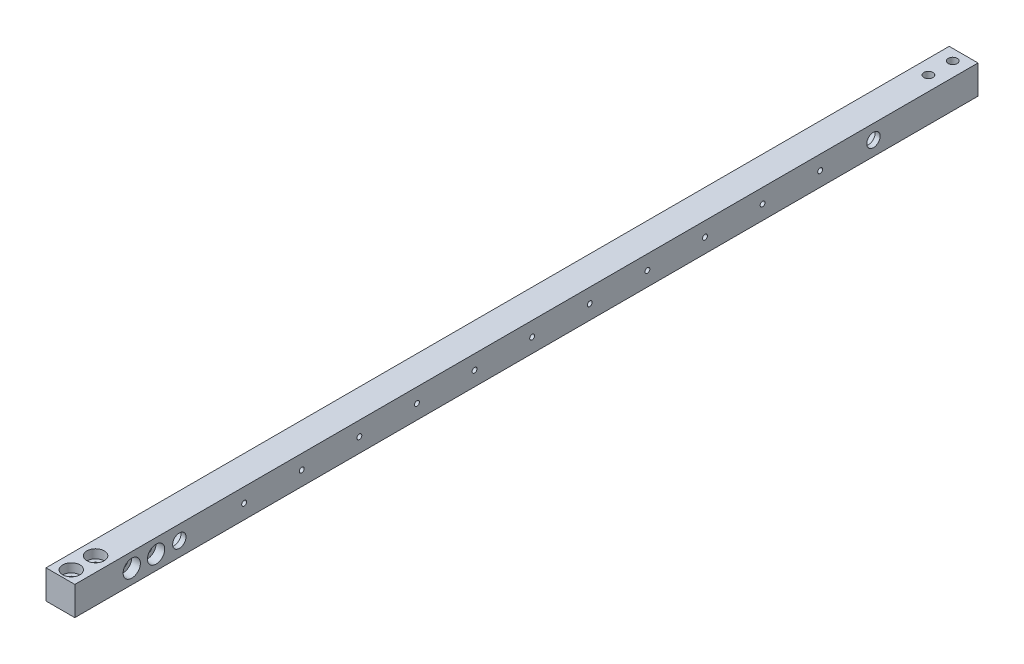
ISO-10303-21;
HEADER;
FILE_DESCRIPTION(('STEP AP214'),'2;1');
FILE_NAME('part.step','',(''),(''),'','','');
FILE_SCHEMA(('AUTOMOTIVE_DESIGN { 1 0 10303 214 1 1 1 1 }'));
ENDSEC;
DATA;
#1=APPLICATION_CONTEXT('core data for automotive mechanical design processes');
#2=APPLICATION_PROTOCOL_DEFINITION('international standard','automotive_design',2000,#1);
#3=PRODUCT_CONTEXT('',#1,'mechanical');
#4=PRODUCT('Part','Part','',(#3));
#5=PRODUCT_RELATED_PRODUCT_CATEGORY('part','',(#4));
#6=PRODUCT_DEFINITION_FORMATION('','',#4);
#7=PRODUCT_DEFINITION_CONTEXT('part definition',#1,'design');
#8=PRODUCT_DEFINITION('design','',#6,#7);
#9=PRODUCT_DEFINITION_SHAPE('','',#8);
#10=(LENGTH_UNIT() NAMED_UNIT(*) SI_UNIT(.MILLI.,.METRE.));
#11=(NAMED_UNIT(*) PLANE_ANGLE_UNIT() SI_UNIT($,.RADIAN.));
#12=(NAMED_UNIT(*) SI_UNIT($,.STERADIAN.) SOLID_ANGLE_UNIT());
#13=UNCERTAINTY_MEASURE_WITH_UNIT(LENGTH_MEASURE(1.E-05),#10,'distance_accuracy_value','');
#14=(GEOMETRIC_REPRESENTATION_CONTEXT(3) GLOBAL_UNCERTAINTY_ASSIGNED_CONTEXT((#13)) GLOBAL_UNIT_ASSIGNED_CONTEXT((#10,
#11,#12)) REPRESENTATION_CONTEXT('',''));
#15=CARTESIAN_POINT('',(0.,0.,0.));
#16=DIRECTION('',(0.,0.,1.));
#17=DIRECTION('',(1.,0.,0.));
#18=AXIS2_PLACEMENT_3D('',#15,#16,#17);
#19=CARTESIAN_POINT('',(0.,0.,497.84));
#20=DIRECTION('',(1.,0.,0.));
#21=DIRECTION('',(0.,1.,0.));
#22=AXIS2_PLACEMENT_3D('',#19,#20,#21);
#23=PLANE('',#22);
#24=CARTESIAN_POINT('',(0.,7.93750000000015,453.04));
#25=DIRECTION('',(1.,0.,0.));
#26=DIRECTION('',(0.,1.,0.));
#27=AXIS2_PLACEMENT_3D('',#24,#25,#26);
#28=CIRCLE('',#27,2.4892);
#29=CARTESIAN_POINT('',(0.,10.4267000000001,453.04));
#30=VERTEX_POINT('',#29);
#31=EDGE_CURVE('E40',#30,#30,#28,.T.);
#32=ORIENTED_EDGE('',*,*,#31,.T.);
#33=EDGE_LOOP('',(#32));
#34=FACE_BOUND('',#33,.T.);
#35=CARTESIAN_POINT('',(0.,7.93750000000015,466.44));
#36=DIRECTION('',(1.,0.,0.));
#37=DIRECTION('',(0.,1.,0.));
#38=AXIS2_PLACEMENT_3D('',#35,#36,#37);
#39=CIRCLE('',#38,2.4892);
#40=CARTESIAN_POINT('',(0.,10.4267000000001,466.44));
#41=VERTEX_POINT('',#40);
#42=EDGE_CURVE('E170',#41,#41,#39,.T.);
#43=ORIENTED_EDGE('',*,*,#42,.T.);
#44=EDGE_LOOP('',(#43));
#45=FACE_BOUND('',#44,.T.);
#46=CARTESIAN_POINT('',(0.,7.93749999999993,404.495));
#47=DIRECTION('',(1.,0.,0.));
#48=DIRECTION('',(0.,0.,-1.));
#49=AXIS2_PLACEMENT_3D('',#46,#47,#48);
#50=CIRCLE('',#49,1.35254999999993);
#51=CARTESIAN_POINT('',(0.,7.93749999999993,403.14245));
#52=VERTEX_POINT('',#51);
#53=EDGE_CURVE('E151',#52,#52,#50,.T.);
#54=ORIENTED_EDGE('',*,*,#53,.T.);
#55=EDGE_LOOP('',(#54));
#56=FACE_BOUND('',#55,.T.);
#57=CARTESIAN_POINT('',(0.,7.93749999999993,372.745));
#58=DIRECTION('',(1.,0.,0.));
#59=DIRECTION('',(0.,0.,-1.));
#60=AXIS2_PLACEMENT_3D('',#57,#58,#59);
#61=CIRCLE('',#60,1.35254999999993);
#62=CARTESIAN_POINT('',(0.,7.93749999999993,371.39245));
#63=VERTEX_POINT('',#62);
#64=EDGE_CURVE('E147',#63,#63,#61,.T.);
#65=ORIENTED_EDGE('',*,*,#64,.T.);
#66=EDGE_LOOP('',(#65));
#67=FACE_BOUND('',#66,.T.);
#68=CARTESIAN_POINT('',(0.,7.93749999999993,340.995));
#69=DIRECTION('',(1.,0.,0.));
#70=DIRECTION('',(0.,0.,-1.));
#71=AXIS2_PLACEMENT_3D('',#68,#69,#70);
#72=CIRCLE('',#71,1.35254999999993);
#73=CARTESIAN_POINT('',(0.,7.93749999999993,339.64245));
#74=VERTEX_POINT('',#73);
#75=EDGE_CURVE('E146',#74,#74,#72,.T.);
#76=ORIENTED_EDGE('',*,*,#75,.T.);
#77=EDGE_LOOP('',(#76));
#78=FACE_BOUND('',#77,.T.);
#79=CARTESIAN_POINT('',(0.,7.93749999999993,309.245));
#80=DIRECTION('',(1.,0.,0.));
#81=DIRECTION('',(0.,0.,-1.));
#82=AXIS2_PLACEMENT_3D('',#79,#80,#81);
#83=CIRCLE('',#82,1.35254999999993);
#84=CARTESIAN_POINT('',(0.,7.93749999999993,307.89245));
#85=VERTEX_POINT('',#84);
#86=EDGE_CURVE('E142',#85,#85,#83,.T.);
#87=ORIENTED_EDGE('',*,*,#86,.T.);
#88=EDGE_LOOP('',(#87));
#89=FACE_BOUND('',#88,.T.);
#90=CARTESIAN_POINT('',(0.,7.93749999999993,277.495));
#91=DIRECTION('',(1.,0.,0.));
#92=DIRECTION('',(0.,0.,-1.));
#93=AXIS2_PLACEMENT_3D('',#90,#91,#92);
#94=CIRCLE('',#93,1.35254999999993);
#95=CARTESIAN_POINT('',(0.,7.93749999999993,276.14245));
#96=VERTEX_POINT('',#95);
#97=EDGE_CURVE('E138',#96,#96,#94,.T.);
#98=ORIENTED_EDGE('',*,*,#97,.T.);
#99=EDGE_LOOP('',(#98));
#100=FACE_BOUND('',#99,.T.);
#101=CARTESIAN_POINT('',(0.,7.93749999999993,245.745));
#102=DIRECTION('',(1.,0.,0.));
#103=DIRECTION('',(0.,0.,-1.));
#104=AXIS2_PLACEMENT_3D('',#101,#102,#103);
#105=CIRCLE('',#104,1.35254999999993);
#106=CARTESIAN_POINT('',(0.,7.93749999999993,244.39245));
#107=VERTEX_POINT('',#106);
#108=EDGE_CURVE('E134',#107,#107,#105,.T.);
#109=ORIENTED_EDGE('',*,*,#108,.T.);
#110=EDGE_LOOP('',(#109));
#111=FACE_BOUND('',#110,.T.);
#112=CARTESIAN_POINT('',(0.,7.93749999999993,213.995));
#113=DIRECTION('',(1.,0.,0.));
#114=DIRECTION('',(0.,0.,-1.));
#115=AXIS2_PLACEMENT_3D('',#112,#113,#114);
#116=CIRCLE('',#115,1.35254999999993);
#117=CARTESIAN_POINT('',(0.,7.93749999999993,212.64245));
#118=VERTEX_POINT('',#117);
#119=EDGE_CURVE('E130',#118,#118,#116,.T.);
#120=ORIENTED_EDGE('',*,*,#119,.T.);
#121=EDGE_LOOP('',(#120));
#122=FACE_BOUND('',#121,.T.);
#123=CARTESIAN_POINT('',(0.,7.93749999999993,182.245));
#124=DIRECTION('',(1.,0.,0.));
#125=DIRECTION('',(0.,0.,-1.));
#126=AXIS2_PLACEMENT_3D('',#123,#124,#125);
#127=CIRCLE('',#126,1.35254999999993);
#128=CARTESIAN_POINT('',(0.,7.93749999999993,180.89245));
#129=VERTEX_POINT('',#128);
#130=EDGE_CURVE('E126',#129,#129,#127,.T.);
#131=ORIENTED_EDGE('',*,*,#130,.T.);
#132=EDGE_LOOP('',(#131));
#133=FACE_BOUND('',#132,.T.);
#134=CARTESIAN_POINT('',(0.,7.93749999999993,150.495));
#135=DIRECTION('',(1.,0.,0.));
#136=DIRECTION('',(0.,0.,-1.));
#137=AXIS2_PLACEMENT_3D('',#134,#135,#136);
#138=CIRCLE('',#137,1.35254999999993);
#139=CARTESIAN_POINT('',(0.,7.93749999999993,149.14245));
#140=VERTEX_POINT('',#139);
#141=EDGE_CURVE('E125',#140,#140,#138,.T.);
#142=ORIENTED_EDGE('',*,*,#141,.T.);
#143=EDGE_LOOP('',(#142));
#144=FACE_BOUND('',#143,.T.);
#145=CARTESIAN_POINT('',(0.,7.93749999999993,118.745));
#146=DIRECTION('',(1.,0.,0.));
#147=DIRECTION('',(0.,0.,-1.));
#148=AXIS2_PLACEMENT_3D('',#145,#146,#147);
#149=CIRCLE('',#148,1.35254999999993);
#150=CARTESIAN_POINT('',(0.,7.93749999999993,117.39245));
#151=VERTEX_POINT('',#150);
#152=EDGE_CURVE('E121',#151,#151,#149,.T.);
#153=ORIENTED_EDGE('',*,*,#152,.T.);
#154=EDGE_LOOP('',(#153));
#155=FACE_BOUND('',#154,.T.);
#156=CARTESIAN_POINT('',(0.,7.93749999999993,86.9949999999997));
#157=DIRECTION('',(1.,0.,0.));
#158=DIRECTION('',(0.,0.,-1.));
#159=AXIS2_PLACEMENT_3D('',#156,#157,#158);
#160=CIRCLE('',#159,1.35254999999993);
#161=CARTESIAN_POINT('',(0.,7.93749999999993,85.6424499999998));
#162=VERTEX_POINT('',#161);
#163=EDGE_CURVE('E120',#162,#162,#160,.T.);
#164=ORIENTED_EDGE('',*,*,#163,.T.);
#165=EDGE_LOOP('',(#164));
#166=FACE_BOUND('',#165,.T.);
#167=CARTESIAN_POINT('',(0.,7.93749999999995,57.6199));
#168=DIRECTION('',(-1.,0.,0.));
#169=DIRECTION('',(0.,1.,0.));
#170=AXIS2_PLACEMENT_3D('',#167,#168,#169);
#171=CIRCLE('',#170,6.81989999999999);
#172=CARTESIAN_POINT('',(0.,14.7573999999999,57.6199));
#173=VERTEX_POINT('',#172);
#174=EDGE_CURVE('E252',#173,#173,#171,.T.);
#175=ORIENTED_EDGE('',*,*,#174,.F.);
#176=EDGE_LOOP('',(#175));
#177=FACE_BOUND('',#176,.T.);
#178=CARTESIAN_POINT('',(0.,7.93749999999999,440.2201));
#179=DIRECTION('',(-1.,0.,0.));
#180=DIRECTION('',(0.,-1.,0.));
#181=AXIS2_PLACEMENT_3D('',#178,#179,#180);
#182=CIRCLE('',#181,6.81989999999997);
#183=CARTESIAN_POINT('',(0.,1.11760000000003,440.2201));
#184=VERTEX_POINT('',#183);
#185=EDGE_CURVE('E256',#184,#184,#182,.T.);
#186=ORIENTED_EDGE('',*,*,#185,.F.);
#187=EDGE_LOOP('',(#186));
#188=FACE_BOUND('',#187,.T.);
#189=DIRECTION('',(0.,-1.,0.));
#190=VECTOR('',#189,1.);
#191=CARTESIAN_POINT('',(0.,0.,0.));
#192=LINE('',#191,#190);
#193=CARTESIAN_POINT('',(0.,15.875,0.));
#194=VERTEX_POINT('',#193);
#195=CARTESIAN_POINT('',(0.,0.,0.));
#196=VERTEX_POINT('',#195);
#197=EDGE_CURVE('E103',#194,#196,#192,.T.);
#198=ORIENTED_EDGE('',*,*,#197,.T.);
#199=DIRECTION('',(0.,0.,-1.));
#200=VECTOR('',#199,1.);
#201=CARTESIAN_POINT('',(0.,0.,497.84));
#202=LINE('',#201,#200);
#203=CARTESIAN_POINT('',(0.,0.,497.84));
#204=VERTEX_POINT('',#203);
#205=EDGE_CURVE('E11',#204,#196,#202,.T.);
#206=ORIENTED_EDGE('',*,*,#205,.F.);
#207=DIRECTION('',(0.,-1.,0.));
#208=VECTOR('',#207,1.);
#209=CARTESIAN_POINT('',(0.,0.,497.84));
#210=LINE('',#209,#208);
#211=CARTESIAN_POINT('',(0.,15.875,497.84));
#212=VERTEX_POINT('',#211);
#213=EDGE_CURVE('E90',#212,#204,#210,.T.);
#214=ORIENTED_EDGE('',*,*,#213,.F.);
#215=DIRECTION('',(0.,0.,-1.));
#216=VECTOR('',#215,1.);
#217=CARTESIAN_POINT('',(0.,15.875,497.84));
#218=LINE('',#217,#216);
#219=EDGE_CURVE('E99',#212,#194,#218,.T.);
#220=ORIENTED_EDGE('',*,*,#219,.T.);
#221=EDGE_LOOP('',(#198,#206,#214,#220));
#222=FACE_BOUND('',#221,.T.);
#223=ADVANCED_FACE('F37',(#34,#45,#56,#67,#78,#89,#100,#111,#122,#133,#144,#155,#166,#177,#188,
#222),#23,.F.);
#224=CARTESIAN_POINT('',(0.,0.,497.84));
#225=DIRECTION('',(0.,1.,0.));
#226=DIRECTION('',(0.,0.,1.));
#227=AXIS2_PLACEMENT_3D('',#224,#225,#226);
#228=PLANE('',#227);
#229=CARTESIAN_POINT('',(7.9374999999996,-2.15233061408304E-13,19.3999999999996));
#230=DIRECTION('',(0.,-1.,0.));
#231=DIRECTION('',(0.,0.,-1.));
#232=AXIS2_PLACEMENT_3D('',#229,#230,#231);
#233=CIRCLE('',#232,4.7625);
#234=CARTESIAN_POINT('',(7.9374999999996,-2.15233061408304E-13,14.6374999999996));
#235=VERTEX_POINT('',#234);
#236=EDGE_CURVE('E172',#235,#235,#233,.T.);
#237=ORIENTED_EDGE('',*,*,#236,.F.);
#238=EDGE_LOOP('',(#237));
#239=FACE_BOUND('',#238,.T.);
#240=CARTESIAN_POINT('',(7.9374999999996,-2.21183856820295E-13,5.99999999999956));
#241=DIRECTION('',(0.,-1.,0.));
#242=DIRECTION('',(0.,0.,-1.));
#243=AXIS2_PLACEMENT_3D('',#240,#241,#242);
#244=CIRCLE('',#243,4.7625);
#245=CARTESIAN_POINT('',(7.9374999999996,-2.21183856820295E-13,1.23749999999956));
#246=VERTEX_POINT('',#245);
#247=EDGE_CURVE('E168',#246,#246,#244,.T.);
#248=ORIENTED_EDGE('',*,*,#247,.F.);
#249=EDGE_LOOP('',(#248));
#250=FACE_BOUND('',#249,.T.);
#251=CARTESIAN_POINT('',(7.93749999999949,0.,478.44));
#252=DIRECTION('',(0.,1.,0.));
#253=DIRECTION('',(0.,0.,1.));
#254=AXIS2_PLACEMENT_3D('',#251,#252,#253);
#255=CIRCLE('',#254,2.4892);
#256=CARTESIAN_POINT('',(7.93749999999949,0.,480.9292));
#257=VERTEX_POINT('',#256);
#258=EDGE_CURVE('E156',#257,#257,#255,.T.);
#259=ORIENTED_EDGE('',*,*,#258,.T.);
#260=EDGE_LOOP('',(#259));
#261=FACE_BOUND('',#260,.T.);
#262=CARTESIAN_POINT('',(7.93749999999949,0.,491.839999999999));
#263=DIRECTION('',(0.,1.,0.));
#264=DIRECTION('',(0.,0.,1.));
#265=AXIS2_PLACEMENT_3D('',#262,#263,#264);
#266=CIRCLE('',#265,2.4892);
#267=CARTESIAN_POINT('',(7.93749999999949,0.,494.329199999999));
#268=VERTEX_POINT('',#267);
#269=EDGE_CURVE('E152',#268,#268,#266,.T.);
#270=ORIENTED_EDGE('',*,*,#269,.T.);
#271=EDGE_LOOP('',(#270));
#272=FACE_BOUND('',#271,.T.);
#273=DIRECTION('',(1.,0.,0.));
#274=VECTOR('',#273,1.);
#275=CARTESIAN_POINT('',(0.,0.,0.));
#276=LINE('',#275,#274);
#277=CARTESIAN_POINT('',(15.875,0.,0.));
#278=VERTEX_POINT('',#277);
#279=EDGE_CURVE('E94',#196,#278,#276,.T.);
#280=ORIENTED_EDGE('',*,*,#279,.T.);
#281=DIRECTION('',(0.,0.,-1.));
#282=VECTOR('',#281,1.);
#283=CARTESIAN_POINT('',(15.875,0.,497.84));
#284=LINE('',#283,#282);
#285=CARTESIAN_POINT('',(15.875,0.,497.84));
#286=VERTEX_POINT('',#285);
#287=EDGE_CURVE('E46',#286,#278,#284,.T.);
#288=ORIENTED_EDGE('',*,*,#287,.F.);
#289=DIRECTION('',(1.,0.,0.));
#290=VECTOR('',#289,1.);
#291=CARTESIAN_POINT('',(0.,0.,497.84));
#292=LINE('',#291,#290);
#293=EDGE_CURVE('E85',#204,#286,#292,.T.);
#294=ORIENTED_EDGE('',*,*,#293,.F.);
#295=ORIENTED_EDGE('',*,*,#205,.T.);
#296=EDGE_LOOP('',(#280,#288,#294,#295));
#297=FACE_BOUND('',#296,.T.);
#298=ADVANCED_FACE('F93',(#239,#250,#261,#272,#297),#228,.F.);
#299=CARTESIAN_POINT('',(15.875,0.,497.84));
#300=DIRECTION('',(-1.,0.,0.));
#301=DIRECTION('',(0.,-1.,0.));
#302=AXIS2_PLACEMENT_3D('',#299,#300,#301);
#303=PLANE('',#302);
#304=CARTESIAN_POINT('',(15.875,7.93750000000015,453.04));
#305=DIRECTION('',(1.,0.,0.));
#306=DIRECTION('',(0.,0.,-1.));
#307=AXIS2_PLACEMENT_3D('',#304,#305,#306);
#308=CIRCLE('',#307,4.7625);
#309=CARTESIAN_POINT('',(15.875,7.93750000000015,448.2775));
#310=VERTEX_POINT('',#309);
#311=EDGE_CURVE('E646',#310,#310,#308,.T.);
#312=ORIENTED_EDGE('',*,*,#311,.F.);
#313=EDGE_LOOP('',(#312));
#314=FACE_BOUND('',#313,.T.);
#315=CARTESIAN_POINT('',(15.875,7.93750000000015,466.44));
#316=DIRECTION('',(1.,0.,0.));
#317=DIRECTION('',(0.,0.,-1.));
#318=AXIS2_PLACEMENT_3D('',#315,#316,#317);
#319=CIRCLE('',#318,4.7625);
#320=CARTESIAN_POINT('',(15.875,7.93750000000015,461.6775));
#321=VERTEX_POINT('',#320);
#322=EDGE_CURVE('E185',#321,#321,#319,.T.);
#323=ORIENTED_EDGE('',*,*,#322,.F.);
#324=EDGE_LOOP('',(#323));
#325=FACE_BOUND('',#324,.T.);
#326=CARTESIAN_POINT('',(15.875,7.93749999999993,404.495));
#327=DIRECTION('',(-1.,0.,0.));
#328=DIRECTION('',(0.,-1.,0.));
#329=AXIS2_PLACEMENT_3D('',#326,#327,#328);
#330=CIRCLE('',#329,1.35254999999997);
#331=CARTESIAN_POINT('',(15.875,6.58494999999997,404.495));
#332=VERTEX_POINT('',#331);
#333=EDGE_CURVE('E148',#332,#332,#330,.T.);
#334=ORIENTED_EDGE('',*,*,#333,.T.);
#335=EDGE_LOOP('',(#334));
#336=FACE_BOUND('',#335,.T.);
#337=CARTESIAN_POINT('',(15.875,7.93749999999993,372.745));
#338=DIRECTION('',(-1.,0.,0.));
#339=DIRECTION('',(0.,-1.,0.));
#340=AXIS2_PLACEMENT_3D('',#337,#338,#339);
#341=CIRCLE('',#340,1.35254999999997);
#342=CARTESIAN_POINT('',(15.875,6.58494999999997,372.745));
#343=VERTEX_POINT('',#342);
#344=EDGE_CURVE('E143',#343,#343,#341,.T.);
#345=ORIENTED_EDGE('',*,*,#344,.T.);
#346=EDGE_LOOP('',(#345));
#347=FACE_BOUND('',#346,.T.);
#348=CARTESIAN_POINT('',(15.875,7.93749999999993,340.995));
#349=DIRECTION('',(-1.,0.,0.));
#350=DIRECTION('',(0.,-1.,0.));
#351=AXIS2_PLACEMENT_3D('',#348,#349,#350);
#352=CIRCLE('',#351,1.35254999999997);
#353=CARTESIAN_POINT('',(15.875,6.58494999999997,340.995));
#354=VERTEX_POINT('',#353);
#355=EDGE_CURVE('E220',#354,#354,#352,.T.);
#356=ORIENTED_EDGE('',*,*,#355,.T.);
#357=EDGE_LOOP('',(#356));
#358=FACE_BOUND('',#357,.T.);
#359=CARTESIAN_POINT('',(15.875,7.93749999999993,309.245));
#360=DIRECTION('',(-1.,0.,0.));
#361=DIRECTION('',(0.,-1.,0.));
#362=AXIS2_PLACEMENT_3D('',#359,#360,#361);
#363=CIRCLE('',#362,1.35254999999997);
#364=CARTESIAN_POINT('',(15.875,6.58494999999997,309.245));
#365=VERTEX_POINT('',#364);
#366=EDGE_CURVE('E139',#365,#365,#363,.T.);
#367=ORIENTED_EDGE('',*,*,#366,.T.);
#368=EDGE_LOOP('',(#367));
#369=FACE_BOUND('',#368,.T.);
#370=CARTESIAN_POINT('',(15.875,7.93749999999993,277.495));
#371=DIRECTION('',(-1.,0.,0.));
#372=DIRECTION('',(0.,-1.,0.));
#373=AXIS2_PLACEMENT_3D('',#370,#371,#372);
#374=CIRCLE('',#373,1.35254999999997);
#375=CARTESIAN_POINT('',(15.875,6.58494999999997,277.495));
#376=VERTEX_POINT('',#375);
#377=EDGE_CURVE('E135',#376,#376,#374,.T.);
#378=ORIENTED_EDGE('',*,*,#377,.T.);
#379=EDGE_LOOP('',(#378));
#380=FACE_BOUND('',#379,.T.);
#381=CARTESIAN_POINT('',(15.875,7.93749999999993,245.745));
#382=DIRECTION('',(-1.,0.,0.));
#383=DIRECTION('',(0.,-1.,0.));
#384=AXIS2_PLACEMENT_3D('',#381,#382,#383);
#385=CIRCLE('',#384,1.35254999999997);
#386=CARTESIAN_POINT('',(15.875,6.58494999999997,245.745));
#387=VERTEX_POINT('',#386);
#388=EDGE_CURVE('E131',#387,#387,#385,.T.);
#389=ORIENTED_EDGE('',*,*,#388,.T.);
#390=EDGE_LOOP('',(#389));
#391=FACE_BOUND('',#390,.T.);
#392=CARTESIAN_POINT('',(15.875,7.93749999999993,213.995));
#393=DIRECTION('',(-1.,0.,0.));
#394=DIRECTION('',(0.,-1.,0.));
#395=AXIS2_PLACEMENT_3D('',#392,#393,#394);
#396=CIRCLE('',#395,1.35254999999997);
#397=CARTESIAN_POINT('',(15.875,6.58494999999997,213.995));
#398=VERTEX_POINT('',#397);
#399=EDGE_CURVE('E127',#398,#398,#396,.T.);
#400=ORIENTED_EDGE('',*,*,#399,.T.);
#401=EDGE_LOOP('',(#400));
#402=FACE_BOUND('',#401,.T.);
#403=CARTESIAN_POINT('',(15.875,7.93749999999993,182.245));
#404=DIRECTION('',(-1.,0.,0.));
#405=DIRECTION('',(0.,-1.,0.));
#406=AXIS2_PLACEMENT_3D('',#403,#404,#405);
#407=CIRCLE('',#406,1.35254999999997);
#408=CARTESIAN_POINT('',(15.875,6.58494999999997,182.245));
#409=VERTEX_POINT('',#408);
#410=EDGE_CURVE('E122',#409,#409,#407,.T.);
#411=ORIENTED_EDGE('',*,*,#410,.T.);
#412=EDGE_LOOP('',(#411));
#413=FACE_BOUND('',#412,.T.);
#414=CARTESIAN_POINT('',(15.875,7.93749999999993,150.495));
#415=DIRECTION('',(-1.,0.,0.));
#416=DIRECTION('',(0.,-1.,0.));
#417=AXIS2_PLACEMENT_3D('',#414,#415,#416);
#418=CIRCLE('',#417,1.35254999999997);
#419=CARTESIAN_POINT('',(15.875,6.58494999999997,150.495));
#420=VERTEX_POINT('',#419);
#421=EDGE_CURVE('E235',#420,#420,#418,.T.);
#422=ORIENTED_EDGE('',*,*,#421,.T.);
#423=EDGE_LOOP('',(#422));
#424=FACE_BOUND('',#423,.T.);
#425=CARTESIAN_POINT('',(15.875,7.93749999999993,118.745));
#426=DIRECTION('',(-1.,0.,0.));
#427=DIRECTION('',(0.,-1.,0.));
#428=AXIS2_PLACEMENT_3D('',#425,#426,#427);
#429=CIRCLE('',#428,1.35254999999997);
#430=CARTESIAN_POINT('',(15.875,6.58494999999997,118.745));
#431=VERTEX_POINT('',#430);
#432=EDGE_CURVE('E117',#431,#431,#429,.T.);
#433=ORIENTED_EDGE('',*,*,#432,.T.);
#434=EDGE_LOOP('',(#433));
#435=FACE_BOUND('',#434,.T.);
#436=CARTESIAN_POINT('',(15.875,7.93749999999993,86.9949999999997));
#437=DIRECTION('',(-1.,0.,0.));
#438=DIRECTION('',(0.,-1.,0.));
#439=AXIS2_PLACEMENT_3D('',#436,#437,#438);
#440=CIRCLE('',#439,1.35254999999997);
#441=CARTESIAN_POINT('',(15.875,6.58494999999997,86.9949999999997));
#442=VERTEX_POINT('',#441);
#443=EDGE_CURVE('E242',#442,#442,#440,.T.);
#444=ORIENTED_EDGE('',*,*,#443,.T.);
#445=EDGE_LOOP('',(#444));
#446=FACE_BOUND('',#445,.T.);
#447=CARTESIAN_POINT('',(15.875,7.93749999999995,57.6199));
#448=DIRECTION('',(-1.,0.,0.));
#449=DIRECTION('',(0.,-1.,0.));
#450=AXIS2_PLACEMENT_3D('',#447,#448,#449);
#451=CIRCLE('',#450,3.68299999999999);
#452=CARTESIAN_POINT('',(15.875,4.25449999999996,57.6199));
#453=VERTEX_POINT('',#452);
#454=EDGE_CURVE('E112',#453,#453,#451,.T.);
#455=ORIENTED_EDGE('',*,*,#454,.T.);
#456=EDGE_LOOP('',(#455));
#457=FACE_BOUND('',#456,.T.);
#458=CARTESIAN_POINT('',(15.875,7.93749999999999,440.2201));
#459=DIRECTION('',(-1.,0.,0.));
#460=DIRECTION('',(0.,-1.,0.));
#461=AXIS2_PLACEMENT_3D('',#458,#459,#460);
#462=CIRCLE('',#461,3.68299999999999);
#463=CARTESIAN_POINT('',(15.875,4.2545,440.2201));
#464=VERTEX_POINT('',#463);
#465=EDGE_CURVE('E249',#464,#464,#462,.T.);
#466=ORIENTED_EDGE('',*,*,#465,.T.);
#467=EDGE_LOOP('',(#466));
#468=FACE_BOUND('',#467,.T.);
#469=DIRECTION('',(0.,1.,0.));
#470=VECTOR('',#469,1.);
#471=CARTESIAN_POINT('',(15.875,0.,0.));
#472=LINE('',#471,#470);
#473=CARTESIAN_POINT('',(15.875,15.875,0.));
#474=VERTEX_POINT('',#473);
#475=EDGE_CURVE('E72',#278,#474,#472,.T.);
#476=ORIENTED_EDGE('',*,*,#475,.T.);
#477=DIRECTION('',(0.,0.,-1.));
#478=VECTOR('',#477,1.);
#479=CARTESIAN_POINT('',(15.875,15.875,497.84));
#480=LINE('',#479,#478);
#481=CARTESIAN_POINT('',(15.875,15.875,497.84));
#482=VERTEX_POINT('',#481);
#483=EDGE_CURVE('E95',#482,#474,#480,.T.);
#484=ORIENTED_EDGE('',*,*,#483,.F.);
#485=DIRECTION('',(0.,1.,0.));
#486=VECTOR('',#485,1.);
#487=CARTESIAN_POINT('',(15.875,0.,497.84));
#488=LINE('',#487,#486);
#489=EDGE_CURVE('E88',#286,#482,#488,.T.);
#490=ORIENTED_EDGE('',*,*,#489,.F.);
#491=ORIENTED_EDGE('',*,*,#287,.T.);
#492=EDGE_LOOP('',(#476,#484,#490,#491));
#493=FACE_BOUND('',#492,.T.);
#494=ADVANCED_FACE('F97',(#314,#325,#336,#347,#358,#369,#380,#391,#402,#413,#424,#435,#446,#457,
#468,#493),#303,.F.);
#495=CARTESIAN_POINT('',(0.,15.875,497.84));
#496=DIRECTION('',(0.,-1.,0.));
#497=DIRECTION('',(0.,0.,-1.));
#498=AXIS2_PLACEMENT_3D('',#495,#496,#497);
#499=PLANE('',#498);
#500=CARTESIAN_POINT('',(7.9374999999996,15.875,19.3999999999996));
#501=DIRECTION('',(0.,-1.,0.));
#502=DIRECTION('',(0.,0.,-1.));
#503=AXIS2_PLACEMENT_3D('',#500,#501,#502);
#504=CIRCLE('',#503,2.4892);
#505=CARTESIAN_POINT('',(7.9374999999996,15.875,16.9107999999996));
#506=VERTEX_POINT('',#505);
#507=EDGE_CURVE('E166',#506,#506,#504,.T.);
#508=ORIENTED_EDGE('',*,*,#507,.T.);
#509=EDGE_LOOP('',(#508));
#510=FACE_BOUND('',#509,.T.);
#511=CARTESIAN_POINT('',(7.9374999999996,15.875,5.99999999999956));
#512=DIRECTION('',(0.,-1.,0.));
#513=DIRECTION('',(0.,0.,-1.));
#514=AXIS2_PLACEMENT_3D('',#511,#512,#513);
#515=CIRCLE('',#514,2.4892);
#516=CARTESIAN_POINT('',(7.9374999999996,15.875,3.51079999999957));
#517=VERTEX_POINT('',#516);
#518=EDGE_CURVE('E161',#517,#517,#515,.T.);
#519=ORIENTED_EDGE('',*,*,#518,.T.);
#520=EDGE_LOOP('',(#519));
#521=FACE_BOUND('',#520,.T.);
#522=CARTESIAN_POINT('',(7.93749999999949,15.8750000000001,478.44));
#523=DIRECTION('',(0.,1.,0.));
#524=DIRECTION('',(0.,0.,1.));
#525=AXIS2_PLACEMENT_3D('',#522,#523,#524);
#526=CIRCLE('',#525,4.7625);
#527=CARTESIAN_POINT('',(7.93749999999949,15.8750000000001,483.2025));
#528=VERTEX_POINT('',#527);
#529=EDGE_CURVE('E164',#528,#528,#526,.T.);
#530=ORIENTED_EDGE('',*,*,#529,.F.);
#531=EDGE_LOOP('',(#530));
#532=FACE_BOUND('',#531,.T.);
#533=CARTESIAN_POINT('',(7.93749999999949,15.8750000000001,491.839999999999));
#534=DIRECTION('',(0.,1.,0.));
#535=DIRECTION('',(0.,0.,1.));
#536=AXIS2_PLACEMENT_3D('',#533,#534,#535);
#537=CIRCLE('',#536,4.7625);
#538=CARTESIAN_POINT('',(7.93749999999949,15.8750000000001,496.602499999999));
#539=VERTEX_POINT('',#538);
#540=EDGE_CURVE('E159',#539,#539,#537,.T.);
#541=ORIENTED_EDGE('',*,*,#540,.F.);
#542=EDGE_LOOP('',(#541));
#543=FACE_BOUND('',#542,.T.);
#544=DIRECTION('',(-1.,0.,0.));
#545=VECTOR('',#544,1.);
#546=CARTESIAN_POINT('',(0.,15.875,0.));
#547=LINE('',#546,#545);
#548=EDGE_CURVE('E78',#474,#194,#547,.T.);
#549=ORIENTED_EDGE('',*,*,#548,.T.);
#550=ORIENTED_EDGE('',*,*,#219,.F.);
#551=DIRECTION('',(-1.,0.,0.));
#552=VECTOR('',#551,1.);
#553=CARTESIAN_POINT('',(0.,15.875,497.84));
#554=LINE('',#553,#552);
#555=EDGE_CURVE('E55',#482,#212,#554,.T.);
#556=ORIENTED_EDGE('',*,*,#555,.F.);
#557=ORIENTED_EDGE('',*,*,#483,.T.);
#558=EDGE_LOOP('',(#549,#550,#556,#557));
#559=FACE_BOUND('',#558,.T.);
#560=ADVANCED_FACE('F281',(#510,#521,#532,#543,#559),#499,.F.);
#561=CARTESIAN_POINT('',(0.,0.,497.84));
#562=DIRECTION('',(0.,0.,-1.));
#563=DIRECTION('',(-1.,0.,0.));
#564=AXIS2_PLACEMENT_3D('',#561,#562,#563);
#565=PLANE('',#564);
#566=ORIENTED_EDGE('',*,*,#213,.T.);
#567=ORIENTED_EDGE('',*,*,#293,.T.);
#568=ORIENTED_EDGE('',*,*,#489,.T.);
#569=ORIENTED_EDGE('',*,*,#555,.T.);
#570=EDGE_LOOP('',(#566,#567,#568,#569));
#571=FACE_BOUND('',#570,.T.);
#572=ADVANCED_FACE('F86',(#571),#565,.F.);
#573=CARTESIAN_POINT('',(0.,0.,0.));
#574=DIRECTION('',(0.,0.,-1.));
#575=DIRECTION('',(-1.,0.,0.));
#576=AXIS2_PLACEMENT_3D('',#573,#574,#575);
#577=PLANE('',#576);
#578=ORIENTED_EDGE('',*,*,#197,.F.);
#579=ORIENTED_EDGE('',*,*,#548,.F.);
#580=ORIENTED_EDGE('',*,*,#475,.F.);
#581=ORIENTED_EDGE('',*,*,#279,.F.);
#582=EDGE_LOOP('',(#578,#579,#580,#581));
#583=FACE_BOUND('',#582,.T.);
#584=ADVANCED_FACE('F271',(#583),#577,.T.);
#585=CARTESIAN_POINT('',(13.08862,7.93749999999999,440.2201));
#586=DIRECTION('',(-1.,0.,0.));
#587=DIRECTION('',(0.,-1.,0.));
#588=AXIS2_PLACEMENT_3D('',#585,#586,#587);
#589=CYLINDRICAL_SURFACE('',#588,6.81989999999997);
#590=CARTESIAN_POINT('',(13.08862,7.93749999999999,440.2201));
#591=DIRECTION('',(-1.,0.,0.));
#592=DIRECTION('',(0.,-1.,0.));
#593=AXIS2_PLACEMENT_3D('',#590,#591,#592);
#594=CIRCLE('',#593,6.81989999999997);
#595=CARTESIAN_POINT('',(13.08862,1.11760000000003,440.2201));
#596=VERTEX_POINT('',#595);
#597=EDGE_CURVE('E106',#596,#596,#594,.T.);
#598=ORIENTED_EDGE('',*,*,#597,.F.);
#599=EDGE_LOOP('',(#598));
#600=FACE_BOUND('',#599,.T.);
#601=ORIENTED_EDGE('',*,*,#185,.T.);
#602=EDGE_LOOP('',(#601));
#603=FACE_BOUND('',#602,.T.);
#604=ADVANCED_FACE('F264',(#600,#603),#589,.F.);
#605=CARTESIAN_POINT('',(13.08862,7.93749999999999,440.2201));
#606=DIRECTION('',(-1.,0.,0.));
#607=DIRECTION('',(0.,-1.,0.));
#608=AXIS2_PLACEMENT_3D('',#605,#606,#607);
#609=PLANE('',#608);
#610=CARTESIAN_POINT('',(13.08862,7.93749999999999,440.2201));
#611=DIRECTION('',(-1.,0.,0.));
#612=DIRECTION('',(0.,0.,1.));
#613=AXIS2_PLACEMENT_3D('',#610,#611,#612);
#614=CIRCLE('',#613,3.68299999999999);
#615=CARTESIAN_POINT('',(13.08862,7.93749999999999,443.9031));
#616=VERTEX_POINT('',#615);
#617=EDGE_CURVE('E115',#616,#616,#614,.T.);
#618=ORIENTED_EDGE('',*,*,#617,.F.);
#619=EDGE_LOOP('',(#618));
#620=FACE_BOUND('',#619,.T.);
#621=ORIENTED_EDGE('',*,*,#597,.T.);
#622=EDGE_LOOP('',(#621));
#623=FACE_BOUND('',#622,.T.);
#624=ADVANCED_FACE('F278',(#620,#623),#609,.T.);
#625=CARTESIAN_POINT('',(13.08862,7.93749999999995,57.6199));
#626=DIRECTION('',(-1.,0.,0.));
#627=DIRECTION('',(0.,-1.,0.));
#628=AXIS2_PLACEMENT_3D('',#625,#626,#627);
#629=CYLINDRICAL_SURFACE('',#628,6.81989999999999);
#630=CARTESIAN_POINT('',(13.08862,7.93749999999995,57.6199));
#631=DIRECTION('',(-1.,0.,0.));
#632=DIRECTION('',(0.,1.,0.));
#633=AXIS2_PLACEMENT_3D('',#630,#631,#632);
#634=CIRCLE('',#633,6.81989999999999);
#635=CARTESIAN_POINT('',(13.08862,14.7573999999999,57.6199));
#636=VERTEX_POINT('',#635);
#637=EDGE_CURVE('E253',#636,#636,#634,.T.);
#638=ORIENTED_EDGE('',*,*,#637,.F.);
#639=EDGE_LOOP('',(#638));
#640=FACE_BOUND('',#639,.T.);
#641=ORIENTED_EDGE('',*,*,#174,.T.);
#642=EDGE_LOOP('',(#641));
#643=FACE_BOUND('',#642,.T.);
#644=ADVANCED_FACE('F369',(#640,#643),#629,.F.);
#645=CARTESIAN_POINT('',(13.08862,7.93749999999995,57.6199));
#646=DIRECTION('',(1.,0.,0.));
#647=DIRECTION('',(0.,1.,0.));
#648=AXIS2_PLACEMENT_3D('',#645,#646,#647);
#649=PLANE('',#648);
#650=CARTESIAN_POINT('',(13.08862,7.93749999999995,57.6199));
#651=DIRECTION('',(-1.,0.,0.));
#652=DIRECTION('',(0.,0.,1.));
#653=AXIS2_PLACEMENT_3D('',#650,#651,#652);
#654=CIRCLE('',#653,3.68299999999999);
#655=CARTESIAN_POINT('',(13.08862,7.93749999999995,61.3029));
#656=VERTEX_POINT('',#655);
#657=EDGE_CURVE('E116',#656,#656,#654,.T.);
#658=ORIENTED_EDGE('',*,*,#657,.F.);
#659=EDGE_LOOP('',(#658));
#660=FACE_BOUND('',#659,.T.);
#661=ORIENTED_EDGE('',*,*,#637,.T.);
#662=EDGE_LOOP('',(#661));
#663=FACE_BOUND('',#662,.T.);
#664=ADVANCED_FACE('F365',(#660,#663),#649,.F.);
#665=CARTESIAN_POINT('',(13.08862,7.93749999999999,440.2201));
#666=DIRECTION('',(-1.,0.,0.));
#667=DIRECTION('',(0.,0.,1.));
#668=AXIS2_PLACEMENT_3D('',#665,#666,#667);
#669=CYLINDRICAL_SURFACE('',#668,3.68299999999999);
#670=ORIENTED_EDGE('',*,*,#617,.T.);
#671=EDGE_LOOP('',(#670));
#672=FACE_BOUND('',#671,.T.);
#673=ORIENTED_EDGE('',*,*,#465,.F.);
#674=EDGE_LOOP('',(#673));
#675=FACE_BOUND('',#674,.T.);
#676=ADVANCED_FACE('F361',(#672,#675),#669,.F.);
#677=CARTESIAN_POINT('',(13.08862,7.93749999999995,57.6199));
#678=DIRECTION('',(-1.,0.,0.));
#679=DIRECTION('',(0.,0.,1.));
#680=AXIS2_PLACEMENT_3D('',#677,#678,#679);
#681=CYLINDRICAL_SURFACE('',#680,3.68299999999999);
#682=ORIENTED_EDGE('',*,*,#657,.T.);
#683=EDGE_LOOP('',(#682));
#684=FACE_BOUND('',#683,.T.);
#685=ORIENTED_EDGE('',*,*,#454,.F.);
#686=EDGE_LOOP('',(#685));
#687=FACE_BOUND('',#686,.T.);
#688=ADVANCED_FACE('F357',(#684,#687),#681,.F.);
#689=CARTESIAN_POINT('',(17.4625,7.93749999999993,86.9949999999997));
#690=DIRECTION('',(1.,0.,0.));
#691=DIRECTION('',(0.,0.,-1.));
#692=AXIS2_PLACEMENT_3D('',#689,#690,#691);
#693=CYLINDRICAL_SURFACE('',#692,1.35254999999997);
#694=ORIENTED_EDGE('',*,*,#163,.F.);
#695=EDGE_LOOP('',(#694));
#696=FACE_BOUND('',#695,.T.);
#697=ORIENTED_EDGE('',*,*,#443,.F.);
#698=EDGE_LOOP('',(#697));
#699=FACE_BOUND('',#698,.T.);
#700=ADVANCED_FACE('F353',(#696,#699),#693,.F.);
#701=CARTESIAN_POINT('',(17.4625,7.93749999999993,118.745));
#702=DIRECTION('',(1.,0.,0.));
#703=DIRECTION('',(0.,0.,-1.));
#704=AXIS2_PLACEMENT_3D('',#701,#702,#703);
#705=CYLINDRICAL_SURFACE('',#704,1.35254999999997);
#706=ORIENTED_EDGE('',*,*,#152,.F.);
#707=EDGE_LOOP('',(#706));
#708=FACE_BOUND('',#707,.T.);
#709=ORIENTED_EDGE('',*,*,#432,.F.);
#710=EDGE_LOOP('',(#709));
#711=FACE_BOUND('',#710,.T.);
#712=ADVANCED_FACE('F349',(#708,#711),#705,.F.);
#713=CARTESIAN_POINT('',(17.4625,7.93749999999993,150.495));
#714=DIRECTION('',(1.,0.,0.));
#715=DIRECTION('',(0.,0.,-1.));
#716=AXIS2_PLACEMENT_3D('',#713,#714,#715);
#717=CYLINDRICAL_SURFACE('',#716,1.35254999999997);
#718=ORIENTED_EDGE('',*,*,#141,.F.);
#719=EDGE_LOOP('',(#718));
#720=FACE_BOUND('',#719,.T.);
#721=ORIENTED_EDGE('',*,*,#421,.F.);
#722=EDGE_LOOP('',(#721));
#723=FACE_BOUND('',#722,.T.);
#724=ADVANCED_FACE('F345',(#720,#723),#717,.F.);
#725=CARTESIAN_POINT('',(17.4625,7.93749999999993,182.245));
#726=DIRECTION('',(1.,0.,0.));
#727=DIRECTION('',(0.,0.,-1.));
#728=AXIS2_PLACEMENT_3D('',#725,#726,#727);
#729=CYLINDRICAL_SURFACE('',#728,1.35254999999997);
#730=ORIENTED_EDGE('',*,*,#130,.F.);
#731=EDGE_LOOP('',(#730));
#732=FACE_BOUND('',#731,.T.);
#733=ORIENTED_EDGE('',*,*,#410,.F.);
#734=EDGE_LOOP('',(#733));
#735=FACE_BOUND('',#734,.T.);
#736=ADVANCED_FACE('F341',(#732,#735),#729,.F.);
#737=CARTESIAN_POINT('',(17.4625,7.93749999999993,213.995));
#738=DIRECTION('',(1.,0.,0.));
#739=DIRECTION('',(0.,0.,-1.));
#740=AXIS2_PLACEMENT_3D('',#737,#738,#739);
#741=CYLINDRICAL_SURFACE('',#740,1.35254999999997);
#742=ORIENTED_EDGE('',*,*,#119,.F.);
#743=EDGE_LOOP('',(#742));
#744=FACE_BOUND('',#743,.T.);
#745=ORIENTED_EDGE('',*,*,#399,.F.);
#746=EDGE_LOOP('',(#745));
#747=FACE_BOUND('',#746,.T.);
#748=ADVANCED_FACE('F337',(#744,#747),#741,.F.);
#749=CARTESIAN_POINT('',(17.4625,7.93749999999993,245.745));
#750=DIRECTION('',(1.,0.,0.));
#751=DIRECTION('',(0.,0.,-1.));
#752=AXIS2_PLACEMENT_3D('',#749,#750,#751);
#753=CYLINDRICAL_SURFACE('',#752,1.35254999999997);
#754=ORIENTED_EDGE('',*,*,#108,.F.);
#755=EDGE_LOOP('',(#754));
#756=FACE_BOUND('',#755,.T.);
#757=ORIENTED_EDGE('',*,*,#388,.F.);
#758=EDGE_LOOP('',(#757));
#759=FACE_BOUND('',#758,.T.);
#760=ADVANCED_FACE('F333',(#756,#759),#753,.F.);
#761=CARTESIAN_POINT('',(17.4625,7.93749999999993,277.495));
#762=DIRECTION('',(1.,0.,0.));
#763=DIRECTION('',(0.,0.,-1.));
#764=AXIS2_PLACEMENT_3D('',#761,#762,#763);
#765=CYLINDRICAL_SURFACE('',#764,1.35254999999997);
#766=ORIENTED_EDGE('',*,*,#97,.F.);
#767=EDGE_LOOP('',(#766));
#768=FACE_BOUND('',#767,.T.);
#769=ORIENTED_EDGE('',*,*,#377,.F.);
#770=EDGE_LOOP('',(#769));
#771=FACE_BOUND('',#770,.T.);
#772=ADVANCED_FACE('F329',(#768,#771),#765,.F.);
#773=CARTESIAN_POINT('',(17.4625,7.93749999999993,309.245));
#774=DIRECTION('',(1.,0.,0.));
#775=DIRECTION('',(0.,0.,-1.));
#776=AXIS2_PLACEMENT_3D('',#773,#774,#775);
#777=CYLINDRICAL_SURFACE('',#776,1.35254999999997);
#778=ORIENTED_EDGE('',*,*,#86,.F.);
#779=EDGE_LOOP('',(#778));
#780=FACE_BOUND('',#779,.T.);
#781=ORIENTED_EDGE('',*,*,#366,.F.);
#782=EDGE_LOOP('',(#781));
#783=FACE_BOUND('',#782,.T.);
#784=ADVANCED_FACE('F325',(#780,#783),#777,.F.);
#785=CARTESIAN_POINT('',(17.4625,7.93749999999993,340.995));
#786=DIRECTION('',(1.,0.,0.));
#787=DIRECTION('',(0.,0.,-1.));
#788=AXIS2_PLACEMENT_3D('',#785,#786,#787);
#789=CYLINDRICAL_SURFACE('',#788,1.35254999999997);
#790=ORIENTED_EDGE('',*,*,#75,.F.);
#791=EDGE_LOOP('',(#790));
#792=FACE_BOUND('',#791,.T.);
#793=ORIENTED_EDGE('',*,*,#355,.F.);
#794=EDGE_LOOP('',(#793));
#795=FACE_BOUND('',#794,.T.);
#796=ADVANCED_FACE('F321',(#792,#795),#789,.F.);
#797=CARTESIAN_POINT('',(17.4625,7.93749999999993,372.745));
#798=DIRECTION('',(1.,0.,0.));
#799=DIRECTION('',(0.,0.,-1.));
#800=AXIS2_PLACEMENT_3D('',#797,#798,#799);
#801=CYLINDRICAL_SURFACE('',#800,1.35254999999997);
#802=ORIENTED_EDGE('',*,*,#64,.F.);
#803=EDGE_LOOP('',(#802));
#804=FACE_BOUND('',#803,.T.);
#805=ORIENTED_EDGE('',*,*,#344,.F.);
#806=EDGE_LOOP('',(#805));
#807=FACE_BOUND('',#806,.T.);
#808=ADVANCED_FACE('F314',(#804,#807),#801,.F.);
#809=CARTESIAN_POINT('',(17.4625,7.93749999999993,404.495));
#810=DIRECTION('',(1.,0.,0.));
#811=DIRECTION('',(0.,0.,-1.));
#812=AXIS2_PLACEMENT_3D('',#809,#810,#811);
#813=CYLINDRICAL_SURFACE('',#812,1.35254999999997);
#814=ORIENTED_EDGE('',*,*,#53,.F.);
#815=EDGE_LOOP('',(#814));
#816=FACE_BOUND('',#815,.T.);
#817=ORIENTED_EDGE('',*,*,#333,.F.);
#818=EDGE_LOOP('',(#817));
#819=FACE_BOUND('',#818,.T.);
#820=ADVANCED_FACE('F304',(#816,#819),#813,.F.);
#821=CARTESIAN_POINT('',(7.93749999999949,15.8750000000001,491.839999999999));
#822=DIRECTION('',(0.,1.,0.));
#823=DIRECTION('',(0.,0.,1.));
#824=AXIS2_PLACEMENT_3D('',#821,#822,#823);
#825=CYLINDRICAL_SURFACE('',#824,2.4892);
#826=CARTESIAN_POINT('',(7.93749999999949,11.0490000000001,491.839999999999));
#827=DIRECTION('',(0.,1.,0.));
#828=DIRECTION('',(0.,0.,1.));
#829=AXIS2_PLACEMENT_3D('',#826,#827,#828);
#830=CIRCLE('',#829,2.4892);
#831=CARTESIAN_POINT('',(7.93749999999949,11.0490000000001,494.329199999999));
#832=VERTEX_POINT('',#831);
#833=EDGE_CURVE('E155',#832,#832,#830,.T.);
#834=ORIENTED_EDGE('',*,*,#833,.T.);
#835=EDGE_LOOP('',(#834));
#836=FACE_BOUND('',#835,.T.);
#837=ORIENTED_EDGE('',*,*,#269,.F.);
#838=EDGE_LOOP('',(#837));
#839=FACE_BOUND('',#838,.T.);
#840=ADVANCED_FACE('F301',(#836,#839),#825,.F.);
#841=CARTESIAN_POINT('',(10.4266999999995,11.0490000000001,491.839999999999));
#842=DIRECTION('',(0.,-1.,0.));
#843=DIRECTION('',(0.,0.,-1.));
#844=AXIS2_PLACEMENT_3D('',#841,#842,#843);
#845=PLANE('',#844);
#846=ORIENTED_EDGE('',*,*,#833,.F.);
#847=EDGE_LOOP('',(#846));
#848=FACE_BOUND('',#847,.T.);
#849=CARTESIAN_POINT('',(7.93749999999949,11.0490000000001,491.839999999999));
#850=DIRECTION('',(0.,1.,0.));
#851=DIRECTION('',(0.,0.,1.));
#852=AXIS2_PLACEMENT_3D('',#849,#850,#851);
#853=CIRCLE('',#852,4.7625);
#854=CARTESIAN_POINT('',(7.93749999999949,11.0490000000001,496.602499999999));
#855=VERTEX_POINT('',#854);
#856=EDGE_CURVE('E209',#855,#855,#853,.T.);
#857=ORIENTED_EDGE('',*,*,#856,.T.);
#858=EDGE_LOOP('',(#857));
#859=FACE_BOUND('',#858,.T.);
#860=ADVANCED_FACE('F303',(#848,#859),#845,.F.);
#861=CARTESIAN_POINT('',(7.93749999999949,15.8750000000001,491.839999999999));
#862=DIRECTION('',(0.,1.,0.));
#863=DIRECTION('',(0.,0.,1.));
#864=AXIS2_PLACEMENT_3D('',#861,#862,#863);
#865=CYLINDRICAL_SURFACE('',#864,4.7625);
#866=ORIENTED_EDGE('',*,*,#856,.F.);
#867=EDGE_LOOP('',(#866));
#868=FACE_BOUND('',#867,.T.);
#869=ORIENTED_EDGE('',*,*,#540,.T.);
#870=EDGE_LOOP('',(#869));
#871=FACE_BOUND('',#870,.T.);
#872=ADVANCED_FACE('F311',(#868,#871),#865,.F.);
#873=CARTESIAN_POINT('',(7.93749999999949,15.8750000000001,478.44));
#874=DIRECTION('',(0.,1.,0.));
#875=DIRECTION('',(0.,0.,1.));
#876=AXIS2_PLACEMENT_3D('',#873,#874,#875);
#877=CYLINDRICAL_SURFACE('',#876,2.4892);
#878=CARTESIAN_POINT('',(7.93749999999949,11.0490000000001,478.44));
#879=DIRECTION('',(0.,1.,0.));
#880=DIRECTION('',(0.,0.,1.));
#881=AXIS2_PLACEMENT_3D('',#878,#879,#880);
#882=CIRCLE('',#881,2.4892);
#883=CARTESIAN_POINT('',(7.93749999999949,11.0490000000001,480.9292));
#884=VERTEX_POINT('',#883);
#885=EDGE_CURVE('E160',#884,#884,#882,.T.);
#886=ORIENTED_EDGE('',*,*,#885,.T.);
#887=EDGE_LOOP('',(#886));
#888=FACE_BOUND('',#887,.T.);
#889=ORIENTED_EDGE('',*,*,#258,.F.);
#890=EDGE_LOOP('',(#889));
#891=FACE_BOUND('',#890,.T.);
#892=ADVANCED_FACE('F465',(#888,#891),#877,.F.);
#893=CARTESIAN_POINT('',(10.4266999999995,11.0490000000001,478.44));
#894=DIRECTION('',(0.,-1.,0.));
#895=DIRECTION('',(0.,0.,-1.));
#896=AXIS2_PLACEMENT_3D('',#893,#894,#895);
#897=PLANE('',#896);
#898=ORIENTED_EDGE('',*,*,#885,.F.);
#899=EDGE_LOOP('',(#898));
#900=FACE_BOUND('',#899,.T.);
#901=CARTESIAN_POINT('',(7.93749999999949,11.0490000000001,478.44));
#902=DIRECTION('',(0.,1.,0.));
#903=DIRECTION('',(0.,0.,1.));
#904=AXIS2_PLACEMENT_3D('',#901,#902,#903);
#905=CIRCLE('',#904,4.7625);
#906=CARTESIAN_POINT('',(7.93749999999949,11.0490000000001,483.2025));
#907=VERTEX_POINT('',#906);
#908=EDGE_CURVE('E202',#907,#907,#905,.T.);
#909=ORIENTED_EDGE('',*,*,#908,.T.);
#910=EDGE_LOOP('',(#909));
#911=FACE_BOUND('',#910,.T.);
#912=ADVANCED_FACE('F474',(#900,#911),#897,.F.);
#913=CARTESIAN_POINT('',(7.93749999999949,15.8750000000001,478.44));
#914=DIRECTION('',(0.,1.,0.));
#915=DIRECTION('',(0.,0.,1.));
#916=AXIS2_PLACEMENT_3D('',#913,#914,#915);
#917=CYLINDRICAL_SURFACE('',#916,4.7625);
#918=ORIENTED_EDGE('',*,*,#908,.F.);
#919=EDGE_LOOP('',(#918));
#920=FACE_BOUND('',#919,.T.);
#921=ORIENTED_EDGE('',*,*,#529,.T.);
#922=EDGE_LOOP('',(#921));
#923=FACE_BOUND('',#922,.T.);
#924=ADVANCED_FACE('F484',(#920,#923),#917,.F.);
#925=CARTESIAN_POINT('',(7.9374999999996,-2.21183856820295E-13,5.99999999999956));
#926=DIRECTION('',(0.,-1.,0.));
#927=DIRECTION('',(0.,0.,-1.));
#928=AXIS2_PLACEMENT_3D('',#925,#926,#927);
#929=CYLINDRICAL_SURFACE('',#928,2.4892);
#930=CARTESIAN_POINT('',(7.9374999999996,4.82599999999978,5.99999999999956));
#931=DIRECTION('',(0.,-1.,0.));
#932=DIRECTION('',(0.,0.,-1.));
#933=AXIS2_PLACEMENT_3D('',#930,#931,#932);
#934=CIRCLE('',#933,2.4892);
#935=CARTESIAN_POINT('',(7.9374999999996,4.82599999999978,3.51079999999956));
#936=VERTEX_POINT('',#935);
#937=EDGE_CURVE('E165',#936,#936,#934,.T.);
#938=ORIENTED_EDGE('',*,*,#937,.T.);
#939=EDGE_LOOP('',(#938));
#940=FACE_BOUND('',#939,.T.);
#941=ORIENTED_EDGE('',*,*,#518,.F.);
#942=EDGE_LOOP('',(#941));
#943=FACE_BOUND('',#942,.T.);
#944=ADVANCED_FACE('F493',(#940,#943),#929,.F.);
#945=CARTESIAN_POINT('',(10.4266999999996,4.82599999999978,5.99999999999956));
#946=DIRECTION('',(0.,1.,0.));
#947=DIRECTION('',(0.,0.,1.));
#948=AXIS2_PLACEMENT_3D('',#945,#946,#947);
#949=PLANE('',#948);
#950=ORIENTED_EDGE('',*,*,#937,.F.);
#951=EDGE_LOOP('',(#950));
#952=FACE_BOUND('',#951,.T.);
#953=CARTESIAN_POINT('',(7.9374999999996,4.82599999999978,5.99999999999956));
#954=DIRECTION('',(0.,-1.,0.));
#955=DIRECTION('',(0.,0.,-1.));
#956=AXIS2_PLACEMENT_3D('',#953,#954,#955);
#957=CIRCLE('',#956,4.7625);
#958=CARTESIAN_POINT('',(7.9374999999996,4.82599999999978,1.23749999999956));
#959=VERTEX_POINT('',#958);
#960=EDGE_CURVE('E195',#959,#959,#957,.T.);
#961=ORIENTED_EDGE('',*,*,#960,.T.);
#962=EDGE_LOOP('',(#961));
#963=FACE_BOUND('',#962,.T.);
#964=ADVANCED_FACE('F517',(#952,#963),#949,.F.);
#965=CARTESIAN_POINT('',(7.9374999999996,-2.21183856820295E-13,5.99999999999956));
#966=DIRECTION('',(0.,-1.,0.));
#967=DIRECTION('',(0.,0.,-1.));
#968=AXIS2_PLACEMENT_3D('',#965,#966,#967);
#969=CYLINDRICAL_SURFACE('',#968,4.7625);
#970=ORIENTED_EDGE('',*,*,#960,.F.);
#971=EDGE_LOOP('',(#970));
#972=FACE_BOUND('',#971,.T.);
#973=ORIENTED_EDGE('',*,*,#247,.T.);
#974=EDGE_LOOP('',(#973));
#975=FACE_BOUND('',#974,.T.);
#976=ADVANCED_FACE('F527',(#972,#975),#969,.F.);
#977=CARTESIAN_POINT('',(7.9374999999996,-2.15233061408304E-13,19.3999999999996));
#978=DIRECTION('',(0.,-1.,0.));
#979=DIRECTION('',(0.,0.,-1.));
#980=AXIS2_PLACEMENT_3D('',#977,#978,#979);
#981=CYLINDRICAL_SURFACE('',#980,2.4892);
#982=CARTESIAN_POINT('',(7.9374999999996,4.82599999999979,19.3999999999996));
#983=DIRECTION('',(0.,-1.,0.));
#984=DIRECTION('',(0.,0.,-1.));
#985=AXIS2_PLACEMENT_3D('',#982,#983,#984);
#986=CIRCLE('',#985,2.4892);
#987=CARTESIAN_POINT('',(7.9374999999996,4.82599999999979,16.9107999999996));
#988=VERTEX_POINT('',#987);
#989=EDGE_CURVE('E169',#988,#988,#986,.T.);
#990=ORIENTED_EDGE('',*,*,#989,.T.);
#991=EDGE_LOOP('',(#990));
#992=FACE_BOUND('',#991,.T.);
#993=ORIENTED_EDGE('',*,*,#507,.F.);
#994=EDGE_LOOP('',(#993));
#995=FACE_BOUND('',#994,.T.);
#996=ADVANCED_FACE('F537',(#992,#995),#981,.F.);
#997=CARTESIAN_POINT('',(10.4266999999996,4.82599999999979,19.3999999999996));
#998=DIRECTION('',(0.,1.,0.));
#999=DIRECTION('',(0.,0.,1.));
#1000=AXIS2_PLACEMENT_3D('',#997,#998,#999);
#1001=PLANE('',#1000);
#1002=ORIENTED_EDGE('',*,*,#989,.F.);
#1003=EDGE_LOOP('',(#1002));
#1004=FACE_BOUND('',#1003,.T.);
#1005=CARTESIAN_POINT('',(7.9374999999996,4.82599999999978,19.3999999999996));
#1006=DIRECTION('',(0.,-1.,0.));
#1007=DIRECTION('',(0.,0.,-1.));
#1008=AXIS2_PLACEMENT_3D('',#1005,#1006,#1007);
#1009=CIRCLE('',#1008,4.7625);
#1010=CARTESIAN_POINT('',(7.9374999999996,4.82599999999978,14.6374999999996));
#1011=VERTEX_POINT('',#1010);
#1012=EDGE_CURVE('E177',#1011,#1011,#1009,.T.);
#1013=ORIENTED_EDGE('',*,*,#1012,.T.);
#1014=EDGE_LOOP('',(#1013));
#1015=FACE_BOUND('',#1014,.T.);
#1016=ADVANCED_FACE('F547',(#1004,#1015),#1001,.F.);
#1017=CARTESIAN_POINT('',(7.9374999999996,-2.15233061408304E-13,19.3999999999996));
#1018=DIRECTION('',(0.,-1.,0.));
#1019=DIRECTION('',(0.,0.,-1.));
#1020=AXIS2_PLACEMENT_3D('',#1017,#1018,#1019);
#1021=CYLINDRICAL_SURFACE('',#1020,4.7625);
#1022=ORIENTED_EDGE('',*,*,#1012,.F.);
#1023=EDGE_LOOP('',(#1022));
#1024=FACE_BOUND('',#1023,.T.);
#1025=ORIENTED_EDGE('',*,*,#236,.T.);
#1026=EDGE_LOOP('',(#1025));
#1027=FACE_BOUND('',#1026,.T.);
#1028=ADVANCED_FACE('F557',(#1024,#1027),#1021,.F.);
#1029=CARTESIAN_POINT('',(15.875,7.93750000000015,466.44));
#1030=DIRECTION('',(1.,0.,0.));
#1031=DIRECTION('',(0.,0.,-1.));
#1032=AXIS2_PLACEMENT_3D('',#1029,#1030,#1031);
#1033=CYLINDRICAL_SURFACE('',#1032,2.4892);
#1034=CARTESIAN_POINT('',(11.049,7.93750000000015,466.44));
#1035=DIRECTION('',(1.,0.,0.));
#1036=DIRECTION('',(0.,0.,-1.));
#1037=AXIS2_PLACEMENT_3D('',#1034,#1035,#1036);
#1038=CIRCLE('',#1037,2.4892);
#1039=CARTESIAN_POINT('',(11.049,7.93750000000015,463.9508));
#1040=VERTEX_POINT('',#1039);
#1041=EDGE_CURVE('E173',#1040,#1040,#1038,.T.);
#1042=ORIENTED_EDGE('',*,*,#1041,.T.);
#1043=EDGE_LOOP('',(#1042));
#1044=FACE_BOUND('',#1043,.T.);
#1045=ORIENTED_EDGE('',*,*,#42,.F.);
#1046=EDGE_LOOP('',(#1045));
#1047=FACE_BOUND('',#1046,.T.);
#1048=ADVANCED_FACE('F567',(#1044,#1047),#1033,.F.);
#1049=CARTESIAN_POINT('',(11.049,10.4267000000001,466.44));
#1050=DIRECTION('',(-1.,0.,0.));
#1051=DIRECTION('',(0.,0.,1.));
#1052=AXIS2_PLACEMENT_3D('',#1049,#1050,#1051);
#1053=PLANE('',#1052);
#1054=ORIENTED_EDGE('',*,*,#1041,.F.);
#1055=EDGE_LOOP('',(#1054));
#1056=FACE_BOUND('',#1055,.T.);
#1057=CARTESIAN_POINT('',(11.049,7.93750000000015,466.44));
#1058=DIRECTION('',(1.,0.,0.));
#1059=DIRECTION('',(0.,0.,-1.));
#1060=AXIS2_PLACEMENT_3D('',#1057,#1058,#1059);
#1061=CIRCLE('',#1060,4.7625);
#1062=CARTESIAN_POINT('',(11.049,7.93750000000015,461.6775));
#1063=VERTEX_POINT('',#1062);
#1064=EDGE_CURVE('E180',#1063,#1063,#1061,.T.);
#1065=ORIENTED_EDGE('',*,*,#1064,.T.);
#1066=EDGE_LOOP('',(#1065));
#1067=FACE_BOUND('',#1066,.T.);
#1068=ADVANCED_FACE('F587',(#1056,#1067),#1053,.F.);
#1069=CARTESIAN_POINT('',(15.875,7.93750000000015,466.44));
#1070=DIRECTION('',(1.,0.,0.));
#1071=DIRECTION('',(0.,0.,-1.));
#1072=AXIS2_PLACEMENT_3D('',#1069,#1070,#1071);
#1073=CYLINDRICAL_SURFACE('',#1072,4.7625);
#1074=ORIENTED_EDGE('',*,*,#1064,.F.);
#1075=EDGE_LOOP('',(#1074));
#1076=FACE_BOUND('',#1075,.T.);
#1077=ORIENTED_EDGE('',*,*,#322,.T.);
#1078=EDGE_LOOP('',(#1077));
#1079=FACE_BOUND('',#1078,.T.);
#1080=ADVANCED_FACE('F596',(#1076,#1079),#1073,.F.);
#1081=CARTESIAN_POINT('',(15.875,7.93750000000015,453.04));
#1082=DIRECTION('',(1.,0.,0.));
#1083=DIRECTION('',(0.,0.,-1.));
#1084=AXIS2_PLACEMENT_3D('',#1081,#1082,#1083);
#1085=CYLINDRICAL_SURFACE('',#1084,2.4892);
#1086=CARTESIAN_POINT('',(11.049,7.93750000000015,453.04));
#1087=DIRECTION('',(1.,0.,0.));
#1088=DIRECTION('',(0.,0.,-1.));
#1089=AXIS2_PLACEMENT_3D('',#1086,#1087,#1088);
#1090=CIRCLE('',#1089,2.4892);
#1091=CARTESIAN_POINT('',(11.049,7.93750000000015,450.5508));
#1092=VERTEX_POINT('',#1091);
#1093=EDGE_CURVE('E648',#1092,#1092,#1090,.T.);
#1094=ORIENTED_EDGE('',*,*,#1093,.T.);
#1095=EDGE_LOOP('',(#1094));
#1096=FACE_BOUND('',#1095,.T.);
#1097=ORIENTED_EDGE('',*,*,#31,.F.);
#1098=EDGE_LOOP('',(#1097));
#1099=FACE_BOUND('',#1098,.T.);
#1100=ADVANCED_FACE('F606',(#1096,#1099),#1085,.F.);
#1101=CARTESIAN_POINT('',(11.049,10.4267000000001,453.04));
#1102=DIRECTION('',(-1.,0.,0.));
#1103=DIRECTION('',(0.,0.,1.));
#1104=AXIS2_PLACEMENT_3D('',#1101,#1102,#1103);
#1105=PLANE('',#1104);
#1106=ORIENTED_EDGE('',*,*,#1093,.F.);
#1107=EDGE_LOOP('',(#1106));
#1108=FACE_BOUND('',#1107,.T.);
#1109=CARTESIAN_POINT('',(11.049,7.93750000000015,453.04));
#1110=DIRECTION('',(1.,0.,0.));
#1111=DIRECTION('',(0.,0.,-1.));
#1112=AXIS2_PLACEMENT_3D('',#1109,#1110,#1111);
#1113=CIRCLE('',#1112,4.7625);
#1114=CARTESIAN_POINT('',(11.049,7.93750000000015,448.2775));
#1115=VERTEX_POINT('',#1114);
#1116=EDGE_CURVE('E643',#1115,#1115,#1113,.T.);
#1117=ORIENTED_EDGE('',*,*,#1116,.T.);
#1118=EDGE_LOOP('',(#1117));
#1119=FACE_BOUND('',#1118,.T.);
#1120=ADVANCED_FACE('F616',(#1108,#1119),#1105,.F.);
#1121=CARTESIAN_POINT('',(15.875,7.93750000000015,453.04));
#1122=DIRECTION('',(1.,0.,0.));
#1123=DIRECTION('',(0.,0.,-1.));
#1124=AXIS2_PLACEMENT_3D('',#1121,#1122,#1123);
#1125=CYLINDRICAL_SURFACE('',#1124,4.7625);
#1126=ORIENTED_EDGE('',*,*,#1116,.F.);
#1127=EDGE_LOOP('',(#1126));
#1128=FACE_BOUND('',#1127,.T.);
#1129=ORIENTED_EDGE('',*,*,#311,.T.);
#1130=EDGE_LOOP('',(#1129));
#1131=FACE_BOUND('',#1130,.T.);
#1132=ADVANCED_FACE('F626',(#1128,#1131),#1125,.F.);
#1133=CLOSED_SHELL('',(#223,#298,#494,#560,#572,#584,#604,#624,#644,#664,#676,#688,#700,#712,
#724,#736,#748,#760,#772,#784,#796,#808,#820,#840,#860,#872,#892,#912,#924,#944,#964,#976,#996,
#1016,#1028,#1048,#1068,#1080,#1100,#1120,#1132));
#1134=MANIFOLD_SOLID_BREP('B2',#1133);
#1135=ADVANCED_BREP_SHAPE_REPRESENTATION('',(#18,#1134),#14);
#1136=SHAPE_DEFINITION_REPRESENTATION(#9,#1135);
ENDSEC;
END-ISO-10303-21;
